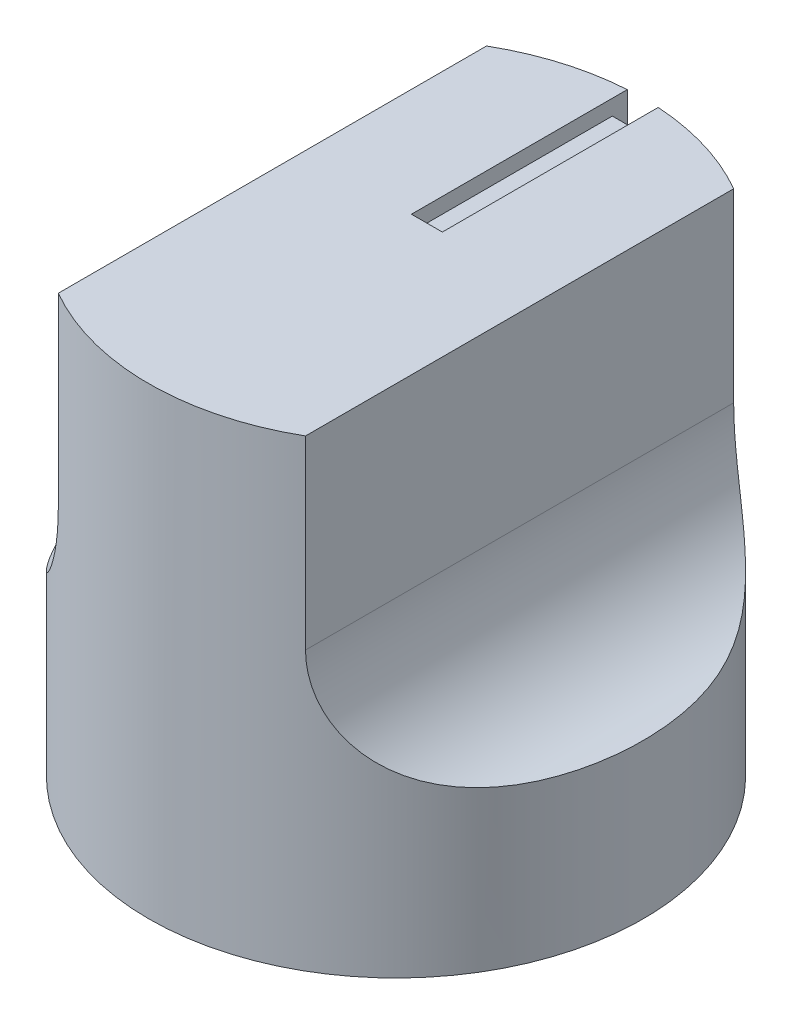
ISO-10303-21;
HEADER;
FILE_DESCRIPTION(('STEP AP214'),'2;1');
FILE_NAME('part.step','',(''),(''),'','','');
FILE_SCHEMA(('AUTOMOTIVE_DESIGN { 1 0 10303 214 1 1 1 1 }'));
ENDSEC;
DATA;
#1=APPLICATION_CONTEXT('core data for automotive mechanical design processes');
#2=APPLICATION_PROTOCOL_DEFINITION('international standard','automotive_design',2000,#1);
#3=PRODUCT_CONTEXT('',#1,'mechanical');
#4=PRODUCT('Part','Part','',(#3));
#5=PRODUCT_RELATED_PRODUCT_CATEGORY('part','',(#4));
#6=PRODUCT_DEFINITION_FORMATION('','',#4);
#7=PRODUCT_DEFINITION_CONTEXT('part definition',#1,'design');
#8=PRODUCT_DEFINITION('design','',#6,#7);
#9=PRODUCT_DEFINITION_SHAPE('','',#8);
#10=(LENGTH_UNIT() NAMED_UNIT(*) SI_UNIT(.MILLI.,.METRE.));
#11=(NAMED_UNIT(*) PLANE_ANGLE_UNIT() SI_UNIT($,.RADIAN.));
#12=(NAMED_UNIT(*) SI_UNIT($,.STERADIAN.) SOLID_ANGLE_UNIT());
#13=UNCERTAINTY_MEASURE_WITH_UNIT(LENGTH_MEASURE(1.E-05),#10,'distance_accuracy_value','');
#14=(GEOMETRIC_REPRESENTATION_CONTEXT(3) GLOBAL_UNCERTAINTY_ASSIGNED_CONTEXT((#13)) GLOBAL_UNIT_ASSIGNED_CONTEXT((#10,
#11,#12)) REPRESENTATION_CONTEXT('',''));
#15=CARTESIAN_POINT('',(0.,0.,0.));
#16=DIRECTION('',(0.,0.,1.));
#17=DIRECTION('',(1.,0.,0.));
#18=AXIS2_PLACEMENT_3D('',#15,#16,#17);
#19=CARTESIAN_POINT('',(0.,3.,0.));
#20=DIRECTION('',(0.,-1.,0.));
#21=DIRECTION('',(0.,0.,-1.));
#22=AXIS2_PLACEMENT_3D('',#19,#20,#21);
#23=CYLINDRICAL_SURFACE('',#22,6.45);
#24=CARTESIAN_POINT('',(0.,3.,0.));
#25=DIRECTION('',(0.,-1.,0.));
#26=DIRECTION('',(0.,0.,-1.));
#27=AXIS2_PLACEMENT_3D('',#24,#25,#26);
#28=CIRCLE('',#27,6.45);
#29=CARTESIAN_POINT('',(0.,3.,-6.45));
#30=VERTEX_POINT('',#29);
#31=EDGE_CURVE('E11',#30,#30,#28,.T.);
#32=ORIENTED_EDGE('',*,*,#31,.T.);
#33=EDGE_LOOP('',(#32));
#34=FACE_BOUND('',#33,.T.);
#35=CARTESIAN_POINT('',(0.,0.,0.));
#36=DIRECTION('',(0.,-1.,0.));
#37=DIRECTION('',(0.,0.,-1.));
#38=AXIS2_PLACEMENT_3D('',#35,#36,#37);
#39=CIRCLE('',#38,6.45);
#40=CARTESIAN_POINT('',(0.,0.,-6.45));
#41=VERTEX_POINT('',#40);
#42=EDGE_CURVE('E43',#41,#41,#39,.T.);
#43=ORIENTED_EDGE('',*,*,#42,.F.);
#44=EDGE_LOOP('',(#43));
#45=FACE_BOUND('',#44,.T.);
#46=ADVANCED_FACE('F40',(#34,#45),#23,.T.);
#47=CARTESIAN_POINT('',(0.,3.,0.));
#48=DIRECTION('',(0.,-1.,0.));
#49=DIRECTION('',(0.,0.,-1.));
#50=AXIS2_PLACEMENT_3D('',#47,#48,#49);
#51=PLANE('',#50);
#52=CARTESIAN_POINT('',(0.,3.,0.));
#53=DIRECTION('',(0.,-1.,0.));
#54=DIRECTION('',(0.,0.,-1.));
#55=AXIS2_PLACEMENT_3D('',#52,#53,#54);
#56=CIRCLE('',#55,3.8);
#57=CARTESIAN_POINT('',(0.,3.,-3.8));
#58=VERTEX_POINT('',#57);
#59=EDGE_CURVE('E50',#58,#58,#56,.T.);
#60=ORIENTED_EDGE('',*,*,#59,.T.);
#61=EDGE_LOOP('',(#60));
#62=FACE_BOUND('',#61,.T.);
#63=ORIENTED_EDGE('',*,*,#31,.F.);
#64=EDGE_LOOP('',(#63));
#65=FACE_BOUND('',#64,.T.);
#66=ADVANCED_FACE('F58',(#62,#65),#51,.F.);
#67=CARTESIAN_POINT('',(0.,0.,0.));
#68=DIRECTION('',(0.,-1.,0.));
#69=DIRECTION('',(0.,0.,-1.));
#70=AXIS2_PLACEMENT_3D('',#67,#68,#69);
#71=PLANE('',#70);
#72=CARTESIAN_POINT('',(0.,0.,0.));
#73=DIRECTION('',(0.,-1.,0.));
#74=DIRECTION('',(0.,0.,-1.));
#75=AXIS2_PLACEMENT_3D('',#72,#73,#74);
#76=CIRCLE('',#75,3.8);
#77=CARTESIAN_POINT('',(0.,0.,-3.8));
#78=VERTEX_POINT('',#77);
#79=EDGE_CURVE('E52',#78,#78,#76,.T.);
#80=ORIENTED_EDGE('',*,*,#79,.F.);
#81=EDGE_LOOP('',(#80));
#82=FACE_BOUND('',#81,.T.);
#83=ORIENTED_EDGE('',*,*,#42,.T.);
#84=EDGE_LOOP('',(#83));
#85=FACE_BOUND('',#84,.T.);
#86=ADVANCED_FACE('F64',(#82,#85),#71,.T.);
#87=CARTESIAN_POINT('',(0.,3.,0.));
#88=DIRECTION('',(0.,-1.,0.));
#89=DIRECTION('',(0.,0.,-1.));
#90=AXIS2_PLACEMENT_3D('',#87,#88,#89);
#91=CYLINDRICAL_SURFACE('',#90,3.8);
#92=ORIENTED_EDGE('',*,*,#59,.F.);
#93=EDGE_LOOP('',(#92));
#94=FACE_BOUND('',#93,.T.);
#95=ORIENTED_EDGE('',*,*,#79,.T.);
#96=EDGE_LOOP('',(#95));
#97=FACE_BOUND('',#96,.T.);
#98=ADVANCED_FACE('F61',(#94,#97),#91,.F.);
#99=CLOSED_SHELL('',(#46,#66,#86,#98));
#100=MANIFOLD_SOLID_BREP('B2',#99);
#101=CARTESIAN_POINT('',(0.,15.,0.));
#102=DIRECTION('',(0.,-1.,0.));
#103=DIRECTION('',(0.,0.,-1.));
#104=AXIS2_PLACEMENT_3D('',#101,#102,#103);
#105=CYLINDRICAL_SURFACE('',#104,8.);
#106=CARTESIAN_POINT('',(0.,0.,0.));
#107=DIRECTION('',(0.,1.,0.));
#108=DIRECTION('',(0.,0.,1.));
#109=AXIS2_PLACEMENT_3D('',#106,#107,#108);
#110=CIRCLE('',#109,8.);
#111=CARTESIAN_POINT('',(-0.5,0.,-7.98435971133565));
#112=VERTEX_POINT('',#111);
#113=CARTESIAN_POINT('',(0.5,0.,-7.98435971133565));
#114=VERTEX_POINT('',#113);
#115=EDGE_CURVE('E248',#112,#114,#110,.T.);
#116=ORIENTED_EDGE('',*,*,#115,.T.);
#117=DIRECTION('',(0.,-1.,0.));
#118=VECTOR('',#117,1.);
#119=CARTESIAN_POINT('',(0.5,15.,-7.98435971133565));
#120=LINE('',#119,#118);
#121=CARTESIAN_POINT('',(0.5,15.,-7.98435971133565));
#122=VERTEX_POINT('',#121);
#123=EDGE_CURVE('E109',#114,#122,#120,.F.);
#124=ORIENTED_EDGE('',*,*,#123,.T.);
#125=CARTESIAN_POINT('',(0.,15.,0.));
#126=DIRECTION('',(0.,1.,0.));
#127=DIRECTION('',(0.,0.,1.));
#128=AXIS2_PLACEMENT_3D('',#125,#126,#127);
#129=CIRCLE('',#128,8.);
#130=CARTESIAN_POINT('',(4.,15.,-6.92820323027551));
#131=VERTEX_POINT('',#130);
#132=EDGE_CURVE('E253',#131,#122,#129,.T.);
#133=ORIENTED_EDGE('',*,*,#132,.F.);
#134=DIRECTION('',(0.,-1.,0.));
#135=VECTOR('',#134,1.);
#136=CARTESIAN_POINT('',(4.,15.,-6.92820323027551));
#137=LINE('',#136,#135);
#138=CARTESIAN_POINT('',(4.,9.,-6.92820323027551));
#139=VERTEX_POINT('',#138);
#140=EDGE_CURVE('E241',#131,#139,#137,.T.);
#141=ORIENTED_EDGE('',*,*,#140,.T.);
#142=CARTESIAN_POINT('',(4.,9.,-6.92820323027551));
#143=CARTESIAN_POINT('',(3.9999835722425,8.90200515013691,-6.92819687410735));
#144=CARTESIAN_POINT('',(4.00360043340264,8.80401188244841,-6.9261240227385));
#145=CARTESIAN_POINT('',(4.01798276798626,8.60873570848839,-6.91779893875372));
#146=CARTESIAN_POINT('',(4.02874781000819,8.51145275970643,-6.91154695835323));
#147=CARTESIAN_POINT('',(4.05728899691143,8.31842478046616,-6.8948286993831));
#148=CARTESIAN_POINT('',(4.07505551335688,8.22267782510478,-6.88436820795136));
#149=CARTESIAN_POINT('',(4.11736554168773,8.03327199832824,-6.85914798190404));
#150=CARTESIAN_POINT('',(4.14190895354734,7.93961309611583,-6.84438831074345));
#151=CARTESIAN_POINT('',(4.19746101487635,7.75501328537845,-6.8104609571265));
#152=CARTESIAN_POINT('',(4.22847203616782,7.66407338800315,-6.79129165729093));
#153=CARTESIAN_POINT('',(4.29654650358197,7.48554906331703,-6.74842986488926));
#154=CARTESIAN_POINT('',(4.33361216584693,7.39796587918973,-6.7247357155819));
#155=CARTESIAN_POINT('',(4.41324580286913,7.22684069241129,-6.6727444832938));
#156=CARTESIAN_POINT('',(4.45580978785766,7.14329581924895,-6.64445073412743));
#157=CARTESIAN_POINT('',(4.54587613481682,6.98067527510326,-6.58315867012874));
#158=CARTESIAN_POINT('',(4.5933803104103,6.90160126200629,-6.55015862587755));
#159=CARTESIAN_POINT('',(4.69290796413624,6.74798783046527,-6.4792254778006));
#160=CARTESIAN_POINT('',(4.74495423874842,6.67347490575537,-6.44126695188476));
#161=CARTESIAN_POINT('',(4.852602391186,6.52978464844852,-6.36056521178928));
#162=CARTESIAN_POINT('',(4.90820553628836,6.46060923713861,-6.31782028814789));
#163=CARTESIAN_POINT('',(5.07916803374714,6.26152367084069,-6.18248162788317));
#164=CARTESIAN_POINT('',(5.19875091452228,6.13994785248332,-6.0827351957496));
#165=CARTESIAN_POINT('',(5.45018821795654,5.91309823520741,-5.8587972011498));
#166=CARTESIAN_POINT('',(5.58234444563209,5.80929448274484,-5.73347656075242));
#167=CARTESIAN_POINT('',(5.84541736244444,5.62605488345185,-5.46501709005642));
#168=CARTESIAN_POINT('',(5.97633345512774,5.54663023729272,-5.32187011200171));
#169=CARTESIAN_POINT('',(6.19989900396769,5.42627315003248,-5.05800022202342));
#170=CARTESIAN_POINT('',(6.29397602939143,5.38067994937706,-4.94053971650036));
#171=CARTESIAN_POINT('',(6.47692504289753,5.29996761174969,-4.69813684152143));
#172=CARTESIAN_POINT('',(6.56579488818492,5.26485276270943,-4.5731914341527));
#173=CARTESIAN_POINT('',(6.7372577248798,5.20344923127442,-4.31662247507116));
#174=CARTESIAN_POINT('',(6.81983688297195,5.17717958940873,-4.18498520999598));
#175=CARTESIAN_POINT('',(6.97767616680622,5.13197837366049,-3.91616493360132));
#176=CARTESIAN_POINT('',(7.05293434827596,5.11304874514201,-3.77898046269936));
#177=CARTESIAN_POINT('',(7.21967322379826,5.07563008091141,-3.45258095752635));
#178=CARTESIAN_POINT('',(7.30800946701544,5.0594639629425,-3.26148721369789));
#179=CARTESIAN_POINT('',(7.46948016307689,5.03449604217453,-2.87250009121431));
#180=CARTESIAN_POINT('',(7.54260970618666,5.02569661506718,-2.6746045404403));
#181=CARTESIAN_POINT('',(7.67304641667369,5.01284593772434,-2.27350709522336));
#182=CARTESIAN_POINT('',(7.73035210338644,5.0087951317102,-2.07030470615671));
#183=CARTESIAN_POINT('',(7.8287230023349,5.00336503278157,-1.66000115984097));
#184=CARTESIAN_POINT('',(7.86978974461307,5.00198548813159,-1.45290037182838));
#185=CARTESIAN_POINT('',(7.93589866811422,5.00037465285776,-1.0331050430258));
#186=CARTESIAN_POINT('',(7.96070244115308,5.00016012370093,-0.82037287857853));
#187=CARTESIAN_POINT('',(7.99317690069333,4.99997282201595,-0.393601563439323));
#188=CARTESIAN_POINT('',(8.00084723416683,5.00000005446914,-0.179562385908006));
#189=CARTESIAN_POINT('',(7.99900409932795,4.99999994600007,0.248535668334523));
#190=CARTESIAN_POINT('',(7.98948318837758,4.99997258144049,0.462594513439574));
#191=CARTESIAN_POINT('',(7.95330499069097,5.00023199564045,0.889257947956167));
#192=CARTESIAN_POINT('',(7.92664758786675,5.00051877652814,1.1018625275062));
#193=CARTESIAN_POINT('',(7.85453693676795,5.0024740538076,1.53524548879987));
#194=CARTESIAN_POINT('',(7.80817778657693,5.00421367453819,1.75587350364351));
#195=CARTESIAN_POINT('',(7.69701030356687,5.01110341546063,2.19243528479369));
#196=CARTESIAN_POINT('',(7.63219829929158,5.01625421462539,2.40836810771346));
#197=CARTESIAN_POINT('',(7.4847372971087,5.03263282779193,2.83360272537685));
#198=CARTESIAN_POINT('',(7.40210551417363,5.04385479236036,3.04291069788407));
#199=CARTESIAN_POINT('',(7.2198176518114,5.07573251191517,3.45319298052435));
#200=CARTESIAN_POINT('',(7.12017065331112,5.09638324460983,3.65417166521782));
#201=CARTESIAN_POINT('',(6.94246644788377,5.14165062466312,3.97787745786033));
#202=CARTESIAN_POINT('',(6.86887366443633,5.16242085718355,4.10361263117451));
#203=CARTESIAN_POINT('',(6.71560401472481,5.21096443384684,4.34990534633432));
#204=CARTESIAN_POINT('',(6.63592882679414,5.23873585096963,4.47046430222393));
#205=CARTESIAN_POINT('',(6.4714163821079,5.30254118291035,4.70545535859407));
#206=CARTESIAN_POINT('',(6.38658755489698,5.33856185864803,4.81989691765251));
#207=CARTESIAN_POINT('',(6.21274572706049,5.4202044149101,5.04198935516655));
#208=CARTESIAN_POINT('',(6.12373363032192,5.46582422867077,5.14964168891702));
#209=CARTESIAN_POINT('',(5.96163169971906,5.55735020283785,5.33581223429792));
#210=CARTESIAN_POINT('',(5.88904755187229,5.60125377643106,5.41575760634648));
#211=CARTESIAN_POINT('',(5.74304972581093,5.6964014240122,5.57033873976989));
#212=CARTESIAN_POINT('',(5.6696362275839,5.74764393244294,5.64497562849256));
#213=CARTESIAN_POINT('',(5.52301366733616,5.85787524674273,5.78850976877604));
#214=CARTESIAN_POINT('',(5.44980458320885,5.91686317899093,5.85740766621815));
#215=CARTESIAN_POINT('',(5.30475134112474,6.04282917569553,5.98909084055749));
#216=CARTESIAN_POINT('',(5.23290719650679,6.1098073181896,6.05187605774336));
#217=CARTESIAN_POINT('',(5.09131854481067,6.25232188729707,6.17147713837903));
#218=CARTESIAN_POINT('',(5.02159394973688,6.3279190267428,6.22824443153859));
#219=CARTESIAN_POINT('',(4.8861625366048,6.48704780335284,6.33504977878511));
#220=CARTESIAN_POINT('',(4.82045530748055,6.57057862648387,6.38508852198298));
#221=CARTESIAN_POINT('',(4.69437261082681,6.74513454723132,6.47834996407541));
#222=CARTESIAN_POINT('',(4.63399688188037,6.83615927697917,6.52157299724322));
#223=CARTESIAN_POINT('',(4.51981351149139,7.02503801310311,6.60122225704981));
#224=CARTESIAN_POINT('',(4.46600489466706,7.12289100190888,6.63764949346169));
#225=CARTESIAN_POINT('',(4.37229876928447,7.31195794770743,6.699683224821));
#226=CARTESIAN_POINT('',(4.33150311480748,7.40247216656111,6.72607320068346));
#227=CARTESIAN_POINT('',(4.25639507181425,7.58742040868101,6.77385290061837));
#228=CARTESIAN_POINT('',(4.22208206778328,7.68185405876557,6.79524309945546));
#229=CARTESIAN_POINT('',(4.16047772400686,7.87384549289628,6.83313506277601));
#230=CARTESIAN_POINT('',(4.13318043533467,7.9714005506986,6.84964097066958));
#231=CARTESIAN_POINT('',(4.08597229460042,8.16891782100564,6.87790536535641));
#232=CARTESIAN_POINT('',(4.06605885415348,8.26887917687969,6.88966551588799));
#233=CARTESIAN_POINT('',(4.03338629630058,8.47364611500904,6.9088485348705));
#234=CARTESIAN_POINT('',(4.0208730611694,8.57850497125034,6.91612264975934));
#235=CARTESIAN_POINT('',(4.00417639291733,8.78891013511775,6.92579129141725));
#236=CARTESIAN_POINT('',(3.99997752893938,8.89445480382254,6.92819485775773));
#237=CARTESIAN_POINT('',(4.,9.,6.92820323027551));
#238=B_SPLINE_CURVE_WITH_KNOTS('',3,(#142,#143,#144,#145,#146,#147,#148,#149,#150,#151,#152,
#153,#154,#155,#156,#157,#158,#159,#160,#161,#162,#163,#164,#165,#166,#167,#168,#169,#170,#171,
#172,#173,#174,#175,#176,#177,#178,#179,#180,#181,#182,#183,#184,#185,#186,#187,#188,#189,#190,
#191,#192,#193,#194,#195,#196,#197,#198,#199,#200,#201,#202,#203,#204,#205,#206,#207,#208,#209,
#210,#211,#212,#213,#214,#215,#216,#217,#218,#219,#220,#221,#222,#223,#224,#225,#226,#227,#228,
#229,#230,#231,#232,#233,#234,#235,#236,#237),.UNSPECIFIED.,.F.,.F.,(4,2,2,2,2,2,2,2,2,2,2,2,2,
2,2,2,2,2,2,2,2,2,2,2,2,2,2,2,2,2,2,2,2,2,2,2,2,2,2,2,2,2,2,2,2,2,2,4),(0.,0.293893692414347,
0.587769649592562,0.881242870651832,1.17471176032868,1.46828846167718,1.76197286084344,
2.05544533736351,2.34902593521375,2.64417557174289,2.93943095920887,3.52953675069302,
4.15607819353379,4.78290706351439,5.25403152085577,5.72534850731815,6.1976736774062,
6.67012394500356,7.30266881905536,7.93541760465959,8.5682255775702,9.20097391274415,
9.84280215588045,10.4846436235174,11.1267630314244,11.7688867892965,12.4444250112155,
13.1200977350561,13.7951206195504,14.4697843676346,14.9109411024683,15.3519765447573,
15.7923090770895,16.2325468994819,16.5819187832327,16.9312162489325,17.2804743505065,
17.629735863446,17.9816304003067,18.3334888700564,18.685330077704,19.0371189642967,
19.3449211343937,19.6526940645851,19.9602051533862,20.2676083429987,20.5847225831056,
20.9012477289834),.UNSPECIFIED.);
#239=CARTESIAN_POINT('',(4.,9.,6.92820323027551));
#240=VERTEX_POINT('',#239);
#241=EDGE_CURVE('E260',#139,#240,#238,.T.);
#242=ORIENTED_EDGE('',*,*,#241,.T.);
#243=DIRECTION('',(0.,-1.,0.));
#244=VECTOR('',#243,1.);
#245=CARTESIAN_POINT('',(4.,15.,6.92820323027551));
#246=LINE('',#245,#244);
#247=CARTESIAN_POINT('',(4.,15.,6.92820323027551));
#248=VERTEX_POINT('',#247);
#249=EDGE_CURVE('E236',#240,#248,#246,.F.);
#250=ORIENTED_EDGE('',*,*,#249,.T.);
#251=CARTESIAN_POINT('',(-4.,15.,6.92820323027551));
#252=VERTEX_POINT('',#251);
#253=EDGE_CURVE('E249',#252,#248,#129,.T.);
#254=ORIENTED_EDGE('',*,*,#253,.F.);
#255=DIRECTION('',(0.,-1.,0.));
#256=VECTOR('',#255,1.);
#257=CARTESIAN_POINT('',(-4.,15.,6.92820323027551));
#258=LINE('',#257,#256);
#259=CARTESIAN_POINT('',(-4.,9.,6.92820323027551));
#260=VERTEX_POINT('',#259);
#261=EDGE_CURVE('E124',#252,#260,#258,.T.);
#262=ORIENTED_EDGE('',*,*,#261,.T.);
#263=CARTESIAN_POINT('',(-4.,9.,-6.92820323027551));
#264=CARTESIAN_POINT('',(-4.00000070990149,9.09776602355344,-6.92820330287687));
#265=CARTESIAN_POINT('',(-4.00358933509886,9.1955573585385,-6.92613477111611));
#266=CARTESIAN_POINT('',(-4.01790451974824,9.39047992600172,-6.91783995927107));
#267=CARTESIAN_POINT('',(-4.02863504847643,9.48761076104948,-6.91161136713138));
#268=CARTESIAN_POINT('',(-4.05712783924524,9.6806575971894,-6.8949247127317));
#269=CARTESIAN_POINT('',(-4.07490316094188,9.77657099865334,-6.88445879452402));
#270=CARTESIAN_POINT('',(-4.11726365035122,9.96634061672385,-6.85920894508524));
#271=CARTESIAN_POINT('',(-4.14185140886115,10.060196035988,-6.84442337095482));
#272=CARTESIAN_POINT('',(-4.19746597192239,10.2450028340334,-6.81045801367739));
#273=CARTESIAN_POINT('',(-4.2284829121503,10.3359584182188,-6.79128495763171));
#274=CARTESIAN_POINT('',(-4.29657133982773,10.5145127823699,-6.74841407897512));
#275=CARTESIAN_POINT('',(-4.33364504247477,10.6021103196382,-6.72471460033428));
#276=CARTESIAN_POINT('',(-4.41328255074227,10.7732327255928,-6.67272014456763));
#277=CARTESIAN_POINT('',(-4.45584043662692,10.8567618537531,-6.64443011416129));
#278=CARTESIAN_POINT('',(-4.54589274893096,11.0193523855586,-6.5831471265146));
#279=CARTESIAN_POINT('',(-4.59338898767261,11.0984121324409,-6.55015244105506));
#280=CARTESIAN_POINT('',(-4.69290956944701,11.2520146454543,-6.47922433425811));
#281=CARTESIAN_POINT('',(-4.74495759102087,11.326529892858,-6.44126450718063));
#282=CARTESIAN_POINT('',(-4.85260944400998,11.4702244410966,-6.36055985576731));
#283=CARTESIAN_POINT('',(-4.90821454297109,11.5394018202184,-6.31781332159535));
#284=CARTESIAN_POINT('',(-5.07917574833982,11.7384841797498,-6.18247519640123));
#285=CARTESIAN_POINT('',(-5.19875484613128,11.8600556964283,-6.0827316935506));
#286=CARTESIAN_POINT('',(-5.45018504864899,12.0868989035289,-5.85880002445516));
#287=CARTESIAN_POINT('',(-5.58233798096011,12.1907004412388,-5.73348269799996));
#288=CARTESIAN_POINT('',(-5.84541095448471,12.3739412271099,-5.46502408895546));
#289=CARTESIAN_POINT('',(-5.97633033585862,12.4533680826962,-5.3218737915539));
#290=CARTESIAN_POINT('',(-6.19989989841727,12.5737273320564,-5.05799916786946));
#291=CARTESIAN_POINT('',(-6.29397777861536,12.6193208986644,-4.94053753275898));
#292=CARTESIAN_POINT('',(-6.47692839150713,12.7000337892319,-4.69813227081212));
#293=CARTESIAN_POINT('',(-6.56579898148471,12.7351488254334,-4.57318560618431));
#294=CARTESIAN_POINT('',(-6.73726158001414,12.796552026693,-4.31661640855879));
#295=CARTESIAN_POINT('',(-6.81983987502246,12.8228213162013,-4.18498028101974));
#296=CARTESIAN_POINT('',(-6.97767756144808,12.8680219769797,-3.9161623913565));
#297=CARTESIAN_POINT('',(-7.05293500875471,12.8869514030528,-3.77897916977416));
#298=CARTESIAN_POINT('',(-7.21967304702145,12.9243698794525,-3.45258130358329));
#299=CARTESIAN_POINT('',(-7.30800914010969,12.9405359771436,-3.26148792098286));
#300=CARTESIAN_POINT('',(-7.46947959456335,12.9655038792807,-2.87250154109829));
#301=CARTESIAN_POINT('',(-7.54260904602782,12.9743033079526,-2.67460637162059));
#302=CARTESIAN_POINT('',(-7.67304587352829,12.9871540207962,-2.27350896426308));
#303=CARTESIAN_POINT('',(-7.73035171063053,12.9912048432641,-2.07030621229374));
#304=CARTESIAN_POINT('',(-7.82872285089215,12.9966349622046,-1.66000192355134));
#305=CARTESIAN_POINT('',(-7.86978968410734,12.9980145104152,-1.45290075601823));
#306=CARTESIAN_POINT('',(-7.93589867463977,12.9996253472799,-1.03310500161348));
#307=CARTESIAN_POINT('',(-7.96070245085685,12.999839876372,-0.820372795362573));
#308=CARTESIAN_POINT('',(-7.99317691001474,13.0000271780208,-0.393601396628912));
#309=CARTESIAN_POINT('',(-8.00084723995513,12.9999999455964,-0.179562177308864));
#310=CARTESIAN_POINT('',(-7.99900409174175,13.0000000540503,0.248535876692019));
#311=CARTESIAN_POINT('',(-7.98948317762883,13.0000274185445,0.462594679794784));
#312=CARTESIAN_POINT('',(-7.95330498032008,12.9997680042235,0.889258030671059));
#313=CARTESIAN_POINT('',(-7.92664758103239,12.9994812232801,1.10186256858273));
#314=CARTESIAN_POINT('',(-7.8545369374175,12.9975259462168,1.53524548489373));
#315=CARTESIAN_POINT('',(-7.80817778820372,12.9957863255236,1.75587349590159));
#316=CARTESIAN_POINT('',(-7.69701030779563,12.9888965848404,2.19243526954058));
#317=CARTESIAN_POINT('',(-7.63219830514726,12.9837457858778,2.4083680887855));
#318=CARTESIAN_POINT('',(-7.48473730429051,12.9673671731528,2.83360270670667));
#319=CARTESIAN_POINT('',(-7.40210552043905,12.9561452086145,3.04291068292555));
#320=CARTESIAN_POINT('',(-7.21981765548318,12.9242674888477,3.45319297311545));
#321=CARTESIAN_POINT('',(-7.12017065527741,12.9036167558951,3.65417166163323));
#322=CARTESIAN_POINT('',(-6.94246647686326,12.8583493827163,3.97787740507314));
#323=CARTESIAN_POINT('',(-6.8688737251568,12.8375791599449,4.10361252743341));
#324=CARTESIAN_POINT('',(-6.71560411070063,12.7890355986533,4.3499051982693));
#325=CARTESIAN_POINT('',(-6.63592892365583,12.7612641841349,4.47046415857415));
#326=CARTESIAN_POINT('',(-6.4714164675322,12.6974588526793,4.70545524185686));
#327=CARTESIAN_POINT('',(-6.38658762719628,12.6614381735612,4.81989682251143));
#328=CARTESIAN_POINT('',(-6.21274576716995,12.5797956056705,5.04198930669649));
#329=CARTESIAN_POINT('',(-6.12373365113981,12.5341757831431,5.14964166515694));
#330=CARTESIAN_POINT('',(-5.96163113307115,12.4426494771741,5.33581288496264));
#331=CARTESIAN_POINT('',(-5.88904640441823,12.398745529412,5.41575886983283));
#332=CARTESIAN_POINT('',(-5.74304943524137,12.3035983330251,5.5703389988925));
#333=CARTESIAN_POINT('',(-5.66963739810161,12.2523568534861,5.64497441699048));
#334=CARTESIAN_POINT('',(-5.52301589536435,12.1421265223312,5.78850765331924));
#335=CARTESIAN_POINT('',(-5.44980641259024,12.0831383495611,5.85740597343075));
#336=CARTESIAN_POINT('',(-5.30475228736507,11.9571717061189,5.98909001356301));
#337=CARTESIAN_POINT('',(-5.23290765997551,11.8901931473304,6.05187566616055));
#338=CARTESIAN_POINT('',(-5.09131824840415,11.747677815345,6.1714773888437));
#339=CARTESIAN_POINT('',(-5.02159337010758,11.6720803481191,6.22824490361441));
#340=CARTESIAN_POINT('',(-4.88615278633931,11.5129406842463,6.33505745289827));
#341=CARTESIAN_POINT('',(-4.82043718083188,11.4293982896392,6.38510231983118));
#342=CARTESIAN_POINT('',(-4.69435260749895,11.2548357471545,6.47836437006798));
#343=CARTESIAN_POINT('',(-4.63398225596499,11.1638175463442,6.521583322658));
#344=CARTESIAN_POINT('',(-4.51980739369818,10.9749508501995,6.60122640137803));
#345=CARTESIAN_POINT('',(-4.46600205313775,10.8771032205785,6.63765138658443));
#346=CARTESIAN_POINT('',(-4.37232722685247,10.6880995086601,6.69966437531455));
#347=CARTESIAN_POINT('',(-4.331556214559,10.5976457795977,6.72603881377807));
#348=CARTESIAN_POINT('',(-4.25647234687928,10.4127826606064,6.77380434945974));
#349=CARTESIAN_POINT('',(-4.22216169807527,10.3183719325495,6.79519374459254));
#350=CARTESIAN_POINT('',(-4.16054936567877,10.1263998903568,6.83309137336605));
#351=CARTESIAN_POINT('',(-4.13324376208968,10.0288403728362,6.84960233774637));
#352=CARTESIAN_POINT('',(-4.08600425338262,9.83123988245688,6.87788694704262));
#353=CARTESIAN_POINT('',(-4.06607304636665,9.73119801562722,6.88965885819933));
#354=CARTESIAN_POINT('',(-4.03462726640266,9.53414255719846,6.90811832761766));
#355=CARTESIAN_POINT('',(-4.02276497517198,9.43720393271993,6.9150165147));
#356=CARTESIAN_POINT('',(-4.00616022966299,9.24247732396191,6.92464966830118));
#357=CARTESIAN_POINT('',(-4.00142030353541,9.14468905047344,6.92738315652564));
#358=CARTESIAN_POINT('',(-3.99912887019422,8.94904717503638,6.92870622523126));
#359=CARTESIAN_POINT('',(-4.00157395297401,8.85119362610691,6.92729777147863));
#360=CARTESIAN_POINT('',(-4.01361664384383,8.65603990182341,6.92032728474647));
#361=CARTESIAN_POINT('',(-4.0232168838967,8.55873994337697,6.91476372334489));
#362=CARTESIAN_POINT('',(-4.04938887621379,8.36588998904652,6.89946938070487));
#363=CARTESIAN_POINT('',(-4.0659271297297,8.27033385665036,6.8897586193481));
#364=CARTESIAN_POINT('',(-4.10576759414658,8.08114058850231,6.86609123955536));
#365=CARTESIAN_POINT('',(-4.1290722692108,7.98750416518483,6.85213307423088));
#366=CARTESIAN_POINT('',(-4.1821277162462,7.80289081601536,6.81988048643909));
#367=CARTESIAN_POINT('',(-4.21187538850573,7.71191263509274,6.80158814873623));
#368=CARTESIAN_POINT('',(-4.27743764138413,7.53316790340114,6.76054900887817));
#369=CARTESIAN_POINT('',(-4.31325443820581,7.44540254011278,6.7378005790603));
#370=CARTESIAN_POINT('',(-4.39053601883212,7.27354178900328,6.68769872909116));
#371=CARTESIAN_POINT('',(-4.43201125264578,7.18945358074779,6.66033676607349));
#372=CARTESIAN_POINT('',(-4.51997420512893,7.02564337868167,6.60095865970766));
#373=CARTESIAN_POINT('',(-4.56646373204203,6.94592297571281,6.56894083591391));
#374=CARTESIAN_POINT('',(-4.71245380462405,6.71411629405484,6.46582761165787));
#375=CARTESIAN_POINT('',(-4.81856222471656,6.56919624706261,6.38761853067557));
#376=CARTESIAN_POINT('',(-5.04526632313501,6.29782934387071,6.21019472491874));
#377=CARTESIAN_POINT('',(-5.16617377792645,6.17198084964538,6.11047373896566));
#378=CARTESIAN_POINT('',(-5.41354621000537,5.9440948986103,5.89242278357558));
#379=CARTESIAN_POINT('',(-5.5400132673066,5.84206644524849,5.77408580590254));
#380=CARTESIAN_POINT('',(-5.75188083151402,5.68984375722648,5.56153650431224));
#381=CARTESIAN_POINT('',(-5.83744627515575,5.63351913601008,5.4717558046432));
#382=CARTESIAN_POINT('',(-6.00684827778962,5.53053819026654,5.28522734732031));
#383=CARTESIAN_POINT('',(-6.0906843235827,5.4838846995148,5.18847755878502));
#384=CARTESIAN_POINT('',(-6.2554328317939,5.39929436669955,4.98862376024073));
#385=CARTESIAN_POINT('',(-6.3363404507889,5.36137145475002,4.88550992387976));
#386=CARTESIAN_POINT('',(-6.49410950578001,5.293293118875,4.67375542023035));
#387=CARTESIAN_POINT('',(-6.57096981229405,5.26313985417757,4.565113226604));
#388=CARTESIAN_POINT('',(-6.74744089466729,5.1996229335774,4.30181256800476));
#389=CARTESIAN_POINT('',(-6.84493209019776,5.16920785268356,4.14501639473949));
#390=CARTESIAN_POINT('',(-7.02942498943289,5.11835788906532,3.82381135200353));
#391=CARTESIAN_POINT('',(-7.11642269353054,5.09792680275589,3.65939961268846));
#392=CARTESIAN_POINT('',(-7.27906552352811,5.06462833656944,3.3241466946258));
#393=CARTESIAN_POINT('',(-7.35469988456443,5.05176809556693,3.1532996086741));
#394=CARTESIAN_POINT('',(-7.49390247201554,5.03152277329121,2.80648294229948));
#395=CARTESIAN_POINT('',(-7.55747174676512,5.02413721616081,2.6305138084649));
#396=CARTESIAN_POINT('',(-7.67390606501344,5.01287193912906,2.268992583558));
#397=CARTESIAN_POINT('',(-7.72638299041423,5.00910669669513,2.0833121102635));
#398=CARTESIAN_POINT('',(-7.81778832716794,5.00389009728358,1.70861853912417));
#399=CARTESIAN_POINT('',(-7.85671654776933,5.00243877288245,1.51960539439818));
#400=CARTESIAN_POINT('',(-7.92080166377113,5.00065545973171,1.13932655115621));
#401=CARTESIAN_POINT('',(-7.94596373247855,5.00032305025259,0.948061726460444));
#402=CARTESIAN_POINT('',(-7.98240830748772,4.9999976164897,0.564209465191368));
#403=CARTESIAN_POINT('',(-7.99369002282592,5.00000461154577,0.371621953874336));
#404=CARTESIAN_POINT('',(-8.00299349065673,4.99999573656709,-0.0444410341855977));
#405=CARTESIAN_POINT('',(-7.99862997793694,4.99997606647677,-0.267973772760683));
#406=CARTESIAN_POINT('',(-7.97121316822046,5.00008077348956,-0.713917203824179));
#407=CARTESIAN_POINT('',(-7.94815699616058,5.00020517275281,-0.936327718411184));
#408=CARTESIAN_POINT('',(-7.88349029772063,5.00156643809818,-1.37861158838073));
#409=CARTESIAN_POINT('',(-7.84186518324387,5.00280417962064,-1.59848280924918));
#410=CARTESIAN_POINT('',(-7.74035856292256,5.00811183013009,-2.03391352517529));
#411=CARTESIAN_POINT('',(-7.68048034380136,5.0121812294071,-2.24947378904006));
#412=CARTESIAN_POINT('',(-7.55404541284902,5.0245167436503,-2.6403646322207));
#413=CARTESIAN_POINT('',(-7.49012393540432,5.03200003069208,-2.81657576613666));
#414=CARTESIAN_POINT('',(-7.35018419159859,5.05250157940943,-3.16383013104305));
#415=CARTESIAN_POINT('',(-7.27416566023942,5.06551996234729,-3.3348732487252));
#416=CARTESIAN_POINT('',(-7.11079027156441,5.09919876132549,-3.67034216097596));
#417=CARTESIAN_POINT('',(-7.02345269983747,5.11984628699431,-3.83477860169782));
#418=CARTESIAN_POINT('',(-6.83828190984266,5.17120948343663,-4.15598566986135));
#419=CARTESIAN_POINT('',(-6.74045273543933,5.2019212843698,-4.31275921719772));
#420=CARTESIAN_POINT('',(-6.56558835409386,5.26524397089478,-4.57274061873253));
#421=CARTESIAN_POINT('',(-6.49080442299516,5.29469164855152,-4.67824152122604));
#422=CARTESIAN_POINT('',(-6.33741436401343,5.36093608824065,-4.88401777042662));
#423=CARTESIAN_POINT('',(-6.25880924438915,5.39773091953074,-4.98429448127651));
#424=CARTESIAN_POINT('',(-6.09876909412752,5.47957545713966,-5.17888699015304));
#425=CARTESIAN_POINT('',(-6.01733704281613,5.52461667446443,-5.27320878522396));
#426=CARTESIAN_POINT('',(-5.8527374988197,5.62383490825504,-5.45532002257753));
#427=CARTESIAN_POINT('',(-5.76957030986473,5.67801033737139,-5.54311059604639));
#428=CARTESIAN_POINT('',(-5.61728668201901,5.78599540285445,-5.6969916946567));
#429=CARTESIAN_POINT('',(-5.5482179011228,5.83826025263288,-5.7642151117045));
#430=CARTESIAN_POINT('',(-5.41080358119952,5.94977262030687,-5.8933939121469));
#431=CARTESIAN_POINT('',(-5.34245790429195,6.00901877987768,-5.95535031629758));
#432=CARTESIAN_POINT('',(-5.20749541218392,6.13461791621789,-6.0737180192116));
#433=CARTESIAN_POINT('',(-5.1408786567809,6.20097113839019,-6.13012912636988));
#434=CARTESIAN_POINT('',(-5.01048237104742,6.34069375119145,-6.23716117042542));
#435=CARTESIAN_POINT('',(-4.94670150538108,6.41405978731863,-6.2877848504772));
#436=CARTESIAN_POINT('',(-4.82270079054602,6.5680071210973,-6.38339421787277));
#437=CARTESIAN_POINT('',(-4.76250176966358,6.64862484662977,-6.42834836393433));
#438=CARTESIAN_POINT('',(-4.64713287355551,6.81628039503238,-6.51223801705804));
#439=CARTESIAN_POINT('',(-4.59196092764808,6.90331554755423,-6.55117600685047));
#440=CARTESIAN_POINT('',(-4.48757009609148,7.08331814030528,-6.62312156061601));
#441=CARTESIAN_POINT('',(-4.43835591117853,7.17629017759168,-6.65612445157361));
#442=CARTESIAN_POINT('',(-4.34681645863214,7.36737328392717,-6.71626301046249));
#443=CARTESIAN_POINT('',(-4.30449040016806,7.46548376131627,-6.7433993520541));
#444=CARTESIAN_POINT('',(-4.23092849432817,7.65699624216335,-6.78976882956742));
#445=CARTESIAN_POINT('',(-4.19903780237081,7.75002892612944,-6.80949307296904));
#446=CARTESIAN_POINT('',(-4.14202357832112,7.93898443911894,-6.8443230619813));
#447=CARTESIAN_POINT('',(-4.11689955901342,8.03490705950729,-6.85942914012062));
#448=CARTESIAN_POINT('',(-4.073814016238,8.22870428121517,-6.88510472358034));
#449=CARTESIAN_POINT('',(-4.05583625250676,8.32657391968175,-6.89568451935484));
#450=CARTESIAN_POINT('',(-4.02721035738711,8.52370914690772,-6.91244198286113));
#451=CARTESIAN_POINT('',(-4.01655805249202,8.62297390787704,-6.9186221572438));
#452=CARTESIAN_POINT('',(-4.00642464439869,8.7687025408082,-6.92449074107638));
#453=CARTESIAN_POINT('',(-4.004016299395,8.81491608073672,-6.92588311217585));
#454=CARTESIAN_POINT('',(-4.00080380539194,8.90741785511395,-6.92773934174441));
#455=CARTESIAN_POINT('',(-3.99999966384932,8.95370608990886,-6.92820319589751));
#456=CARTESIAN_POINT('',(-4.,9.,-6.92820323027551));
#457=B_SPLINE_CURVE_WITH_KNOTS('',3,(#263,#264,#265,#266,#267,#268,#269,#270,#271,#272,#273,
#274,#275,#276,#277,#278,#279,#280,#281,#282,#283,#284,#285,#286,#287,#288,#289,#290,#291,#292,
#293,#294,#295,#296,#297,#298,#299,#300,#301,#302,#303,#304,#305,#306,#307,#308,#309,#310,#311,
#312,#313,#314,#315,#316,#317,#318,#319,#320,#321,#322,#323,#324,#325,#326,#327,#328,#329,#330,
#331,#332,#333,#334,#335,#336,#337,#338,#339,#340,#341,#342,#343,#344,#345,#346,#347,#348,#349,
#350,#351,#352,#353,#354,#355,#356,#357,#358,#359,#360,#361,#362,#363,#364,#365,#366,#367,#368,
#369,#370,#371,#372,#373,#374,#375,#376,#377,#378,#379,#380,#381,#382,#383,#384,#385,#386,#387,
#388,#389,#390,#391,#392,#393,#394,#395,#396,#397,#398,#399,#400,#401,#402,#403,#404,#405,#406,
#407,#408,#409,#410,#411,#412,#413,#414,#415,#416,#417,#418,#419,#420,#421,#422,#423,#424,#425,
#426,#427,#428,#429,#430,#431,#432,#433,#434,#435,#436,#437,#438,#439,#440,#441,#442,#443,#444,
#445,#446,#447,#448,#449,#450,#451,#452,#453,#454,#455,#456),.UNSPECIFIED.,.T.,.F.,(4,2,2,2,2,2,
2,2,2,2,2,2,2,2,2,2,2,2,2,2,2,2,2,2,2,2,2,2,2,2,2,2,2,2,2,2,2,2,2,2,2,2,2,2,2,2,2,2,2,2,2,2,2,2,
2,2,2,2,2,2,2,2,2,2,2,2,2,2,2,2,2,2,2,2,2,2,2,2,2,2,2,2,2,2,2,2,2,2,2,2,2,2,2,2,2,2,4),(0.,
0.293254362587133,0.586671844239998,0.880635827531812,1.17471176032936,1.46833978729855,
1.76207544705924,2.0554966577744,2.34902593355566,2.6441850719655,2.93944998108342,
3.52953679129149,4.15606294410501,4.78290710959589,5.25403594197832,5.72535729420498,
6.19767809775008,6.67012398946573,7.30266769357557,7.9354153165455,8.56822445605422,
9.20097395741387,9.84280232599552,10.4846439180466,11.1267632009512,11.7688868339664,
12.4444250440434,13.1200977559639,13.7951206517759,14.4697844123016,14.9109409652325,
15.3519764155615,15.7923090229214,16.2325469441126,16.5819215859758,16.9312121346714,
17.2804720952953,17.6297359078488,17.9816319170545,18.3335366965956,18.6853501117171,
19.0371190109063,19.3447208822932,19.6524276274145,19.9599618035524,20.2676083875273,
20.5609755996954,20.8544469207468,21.1477789827513,21.4412189977091,21.7332582152355,
22.0254039199002,22.3174093848833,22.6095217093385,22.9021810001496,23.1949461842359,
23.7798422027086,24.3803954457432,24.9811753184219,25.3893126902401,25.7975694834559,
26.2064732265247,26.615490483949,27.1760246640117,27.7367718217192,28.2980468885264,
28.8592731638203,29.4377131312314,30.0161612421399,30.5943918232097,31.1726553528738,
31.8425784270679,32.5126045597207,33.1831580065628,33.8535907822537,34.4158801574984,
34.9781818519534,35.5395377812069,36.1006781148237,36.4982467798697,36.8957111058941,
37.2927685515561,37.6897570672926,38.0183555026648,38.346890109228,38.6754360635668,
39.0038256406336,39.3339683310079,39.6639744130295,39.9942391993406,40.324466040928,
40.6250136257693,40.9255395647321,41.2253785828004,41.5250466328488,41.6639070211342,
41.8027680548759),.UNSPECIFIED.);
#458=CARTESIAN_POINT('',(-4.,9.,-6.92820323027551));
#459=VERTEX_POINT('',#458);
#460=EDGE_CURVE('E268',#260,#459,#457,.T.);
#461=ORIENTED_EDGE('',*,*,#460,.T.);
#462=DIRECTION('',(0.,-1.,0.));
#463=VECTOR('',#462,1.);
#464=CARTESIAN_POINT('',(-4.,15.,-6.92820323027551));
#465=LINE('',#464,#463);
#466=CARTESIAN_POINT('',(-4.,15.,-6.92820323027551));
#467=VERTEX_POINT('',#466);
#468=EDGE_CURVE('E244',#459,#467,#465,.F.);
#469=ORIENTED_EDGE('',*,*,#468,.T.);
#470=CARTESIAN_POINT('',(-0.5,15.,-7.98435971133565));
#471=VERTEX_POINT('',#470);
#472=EDGE_CURVE('E252',#471,#467,#129,.T.);
#473=ORIENTED_EDGE('',*,*,#472,.F.);
#474=DIRECTION('',(0.,-1.,0.));
#475=VECTOR('',#474,1.);
#476=CARTESIAN_POINT('',(-0.5,15.,-7.98435971133565));
#477=LINE('',#476,#475);
#478=EDGE_CURVE('E38',#471,#112,#477,.T.);
#479=ORIENTED_EDGE('',*,*,#478,.T.);
#480=EDGE_LOOP('',(#116,#124,#133,#141,#242,#250,#254,#262,#461,#469,#473,#479));
#481=FACE_BOUND('',#480,.T.);
#482=ADVANCED_FACE('F101',(#481),#105,.T.);
#483=CARTESIAN_POINT('',(0.,0.,0.));
#484=DIRECTION('',(0.,1.,0.));
#485=DIRECTION('',(0.,0.,1.));
#486=AXIS2_PLACEMENT_3D('',#483,#484,#485);
#487=PLANE('',#486);
#488=CARTESIAN_POINT('',(0.,0.,0.));
#489=DIRECTION('',(0.,-1.,0.));
#490=DIRECTION('',(0.,0.,-1.));
#491=AXIS2_PLACEMENT_3D('',#488,#489,#490);
#492=CIRCLE('',#491,6.5);
#493=CARTESIAN_POINT('',(0.,0.,-6.5));
#494=VERTEX_POINT('',#493);
#495=EDGE_CURVE('E220',#494,#494,#492,.T.);
#496=ORIENTED_EDGE('',*,*,#495,.F.);
#497=EDGE_LOOP('',(#496));
#498=FACE_BOUND('',#497,.T.);
#499=DIRECTION('',(0.,0.,-1.));
#500=VECTOR('',#499,1.);
#501=CARTESIAN_POINT('',(0.5,0.,-7.5));
#502=LINE('',#501,#500);
#503=CARTESIAN_POINT('',(0.5,0.,-7.5));
#504=VERTEX_POINT('',#503);
#505=EDGE_CURVE('E192',#504,#114,#502,.T.);
#506=ORIENTED_EDGE('',*,*,#505,.T.);
#507=ORIENTED_EDGE('',*,*,#115,.F.);
#508=DIRECTION('',(0.,0.,-1.));
#509=VECTOR('',#508,1.);
#510=CARTESIAN_POINT('',(-0.5,0.,-7.5));
#511=LINE('',#510,#509);
#512=CARTESIAN_POINT('',(-0.5,0.,-7.5));
#513=VERTEX_POINT('',#512);
#514=EDGE_CURVE('E209',#513,#112,#511,.T.);
#515=ORIENTED_EDGE('',*,*,#514,.F.);
#516=DIRECTION('',(1.,0.,0.));
#517=VECTOR('',#516,1.);
#518=CARTESIAN_POINT('',(0.5,0.,-7.5));
#519=LINE('',#518,#517);
#520=EDGE_CURVE('E351',#513,#504,#519,.T.);
#521=ORIENTED_EDGE('',*,*,#520,.T.);
#522=EDGE_LOOP('',(#506,#507,#515,#521));
#523=FACE_BOUND('',#522,.T.);
#524=ADVANCED_FACE('F286',(#498,#523),#487,.F.);
#525=CARTESIAN_POINT('',(0.,14.5,0.));
#526=DIRECTION('',(0.,-1.,0.));
#527=DIRECTION('',(0.,0.,-1.));
#528=AXIS2_PLACEMENT_3D('',#525,#526,#527);
#529=PLANE('',#528);
#530=DIRECTION('',(-1.,0.,0.));
#531=VECTOR('',#530,1.);
#532=CARTESIAN_POINT('',(0.5,14.5,-7.5));
#533=LINE('',#532,#531);
#534=CARTESIAN_POINT('',(0.5,14.5,-7.5));
#535=VERTEX_POINT('',#534);
#536=CARTESIAN_POINT('',(-0.5,14.5,-7.5));
#537=VERTEX_POINT('',#536);
#538=EDGE_CURVE('E177',#535,#537,#533,.T.);
#539=ORIENTED_EDGE('',*,*,#538,.T.);
#540=DIRECTION('',(0.,0.,1.));
#541=VECTOR('',#540,1.);
#542=CARTESIAN_POINT('',(-0.5,14.5,-1.));
#543=LINE('',#542,#541);
#544=CARTESIAN_POINT('',(-0.5,14.5,-1.));
#545=VERTEX_POINT('',#544);
#546=EDGE_CURVE('E202',#537,#545,#543,.T.);
#547=ORIENTED_EDGE('',*,*,#546,.T.);
#548=DIRECTION('',(1.,0.,0.));
#549=VECTOR('',#548,1.);
#550=CARTESIAN_POINT('',(-0.5,14.5,-1.));
#551=LINE('',#550,#549);
#552=CARTESIAN_POINT('',(0.5,14.5,-1.));
#553=VERTEX_POINT('',#552);
#554=EDGE_CURVE('E196',#545,#553,#551,.T.);
#555=ORIENTED_EDGE('',*,*,#554,.T.);
#556=DIRECTION('',(0.,0.,-1.));
#557=VECTOR('',#556,1.);
#558=CARTESIAN_POINT('',(0.5,14.5,-1.));
#559=LINE('',#558,#557);
#560=EDGE_CURVE('E189',#553,#535,#559,.T.);
#561=ORIENTED_EDGE('',*,*,#560,.T.);
#562=EDGE_LOOP('',(#539,#547,#555,#561));
#563=FACE_BOUND('',#562,.T.);
#564=ADVANCED_FACE('F194',(#563),#529,.F.);
#565=CARTESIAN_POINT('',(0.,0.,0.));
#566=DIRECTION('',(0.,-1.,0.));
#567=DIRECTION('',(0.,0.,-1.));
#568=AXIS2_PLACEMENT_3D('',#565,#566,#567);
#569=CIRCLE('',#568,3.);
#570=CARTESIAN_POINT('',(0.,0.,-3.));
#571=VERTEX_POINT('',#570);
#572=EDGE_CURVE('E223',#571,#571,#569,.T.);
#573=ORIENTED_EDGE('',*,*,#572,.F.);
#574=EDGE_LOOP('',(#573));
#575=FACE_BOUND('',#574,.T.);
#576=CARTESIAN_POINT('',(0.,0.,0.));
#577=DIRECTION('',(0.,-1.,0.));
#578=DIRECTION('',(0.,0.,-1.));
#579=AXIS2_PLACEMENT_3D('',#576,#577,#578);
#580=CIRCLE('',#579,3.75);
#581=CARTESIAN_POINT('',(0.,0.,-3.75));
#582=VERTEX_POINT('',#581);
#583=EDGE_CURVE('E214',#582,#582,#580,.T.);
#584=ORIENTED_EDGE('',*,*,#583,.T.);
#585=EDGE_LOOP('',(#584));
#586=FACE_BOUND('',#585,.T.);
#587=ADVANCED_FACE('F289',(#575,#586),#487,.F.);
#588=CARTESIAN_POINT('',(0.,13.,0.));
#589=DIRECTION('',(0.,-1.,0.));
#590=DIRECTION('',(0.,0.,-1.));
#591=AXIS2_PLACEMENT_3D('',#588,#589,#590);
#592=CYLINDRICAL_SURFACE('',#591,3.);
#593=CARTESIAN_POINT('',(0.,13.,0.));
#594=DIRECTION('',(0.,-1.,0.));
#595=DIRECTION('',(0.,0.,-1.));
#596=AXIS2_PLACEMENT_3D('',#593,#594,#595);
#597=CIRCLE('',#596,3.);
#598=CARTESIAN_POINT('',(0.,13.,-3.));
#599=VERTEX_POINT('',#598);
#600=EDGE_CURVE('E228',#599,#599,#597,.T.);
#601=ORIENTED_EDGE('',*,*,#600,.F.);
#602=EDGE_LOOP('',(#601));
#603=FACE_BOUND('',#602,.T.);
#604=ORIENTED_EDGE('',*,*,#572,.T.);
#605=EDGE_LOOP('',(#604));
#606=FACE_BOUND('',#605,.T.);
#607=ADVANCED_FACE('F299',(#603,#606),#592,.F.);
#608=CARTESIAN_POINT('',(0.,13.,0.));
#609=DIRECTION('',(0.,-1.,0.));
#610=DIRECTION('',(0.,0.,-1.));
#611=AXIS2_PLACEMENT_3D('',#608,#609,#610);
#612=PLANE('',#611);
#613=ORIENTED_EDGE('',*,*,#600,.T.);
#614=EDGE_LOOP('',(#613));
#615=FACE_BOUND('',#614,.T.);
#616=ADVANCED_FACE('F304',(#615),#612,.T.);
#617=CARTESIAN_POINT('',(0.,3.,0.));
#618=DIRECTION('',(0.,-1.,0.));
#619=DIRECTION('',(0.,0.,-1.));
#620=AXIS2_PLACEMENT_3D('',#617,#618,#619);
#621=CYLINDRICAL_SURFACE('',#620,3.75);
#622=CARTESIAN_POINT('',(0.,3.,0.));
#623=DIRECTION('',(0.,-1.,0.));
#624=DIRECTION('',(0.,0.,-1.));
#625=AXIS2_PLACEMENT_3D('',#622,#623,#624);
#626=CIRCLE('',#625,3.75);
#627=CARTESIAN_POINT('',(0.,3.,-3.75));
#628=VERTEX_POINT('',#627);
#629=EDGE_CURVE('E216',#628,#628,#626,.T.);
#630=ORIENTED_EDGE('',*,*,#629,.T.);
#631=EDGE_LOOP('',(#630));
#632=FACE_BOUND('',#631,.T.);
#633=ORIENTED_EDGE('',*,*,#583,.F.);
#634=EDGE_LOOP('',(#633));
#635=FACE_BOUND('',#634,.T.);
#636=ADVANCED_FACE('F311',(#632,#635),#621,.T.);
#637=CARTESIAN_POINT('',(0.,3.,0.));
#638=DIRECTION('',(0.,-1.,0.));
#639=DIRECTION('',(0.,0.,-1.));
#640=AXIS2_PLACEMENT_3D('',#637,#638,#639);
#641=CYLINDRICAL_SURFACE('',#640,6.5);
#642=CARTESIAN_POINT('',(0.,3.,0.));
#643=DIRECTION('',(0.,-1.,0.));
#644=DIRECTION('',(0.,0.,-1.));
#645=AXIS2_PLACEMENT_3D('',#642,#643,#644);
#646=CIRCLE('',#645,6.5);
#647=CARTESIAN_POINT('',(0.,3.,-6.5));
#648=VERTEX_POINT('',#647);
#649=EDGE_CURVE('E219',#648,#648,#646,.T.);
#650=ORIENTED_EDGE('',*,*,#649,.F.);
#651=EDGE_LOOP('',(#650));
#652=FACE_BOUND('',#651,.T.);
#653=ORIENTED_EDGE('',*,*,#495,.T.);
#654=EDGE_LOOP('',(#653));
#655=FACE_BOUND('',#654,.T.);
#656=ADVANCED_FACE('F313',(#652,#655),#641,.F.);
#657=CARTESIAN_POINT('',(0.,3.,0.));
#658=DIRECTION('',(0.,-1.,0.));
#659=DIRECTION('',(0.,0.,-1.));
#660=AXIS2_PLACEMENT_3D('',#657,#658,#659);
#661=PLANE('',#660);
#662=ORIENTED_EDGE('',*,*,#629,.F.);
#663=EDGE_LOOP('',(#662));
#664=FACE_BOUND('',#663,.T.);
#665=ORIENTED_EDGE('',*,*,#649,.T.);
#666=EDGE_LOOP('',(#665));
#667=FACE_BOUND('',#666,.T.);
#668=ADVANCED_FACE('F279',(#664,#667),#661,.T.);
#669=CARTESIAN_POINT('',(8.,9.,-15.));
#670=DIRECTION('',(0.,0.,1.));
#671=DIRECTION('',(1.,0.,0.));
#672=AXIS2_PLACEMENT_3D('',#669,#670,#671);
#673=CYLINDRICAL_SURFACE('',#672,4.);
#674=DIRECTION('',(0.,0.,1.));
#675=VECTOR('',#674,1.);
#676=CARTESIAN_POINT('',(4.,9.,-15.));
#677=LINE('',#676,#675);
#678=EDGE_CURVE('E231',#139,#240,#677,.T.);
#679=ORIENTED_EDGE('',*,*,#678,.T.);
#680=ORIENTED_EDGE('',*,*,#241,.F.);
#681=EDGE_LOOP('',(#679,#680));
#682=FACE_BOUND('',#681,.T.);
#683=ADVANCED_FACE('F273',(#682),#673,.F.);
#684=CARTESIAN_POINT('',(4.,15.,-15.));
#685=DIRECTION('',(-1.,0.,0.));
#686=DIRECTION('',(0.,0.,1.));
#687=AXIS2_PLACEMENT_3D('',#684,#685,#686);
#688=PLANE('',#687);
#689=DIRECTION('',(0.,0.,1.));
#690=VECTOR('',#689,1.);
#691=CARTESIAN_POINT('',(4.,15.,0.));
#692=LINE('',#691,#690);
#693=EDGE_CURVE('E256',#131,#248,#692,.T.);
#694=ORIENTED_EDGE('',*,*,#693,.T.);
#695=ORIENTED_EDGE('',*,*,#249,.F.);
#696=ORIENTED_EDGE('',*,*,#678,.F.);
#697=ORIENTED_EDGE('',*,*,#140,.F.);
#698=EDGE_LOOP('',(#694,#695,#696,#697));
#699=FACE_BOUND('',#698,.T.);
#700=ADVANCED_FACE('F278',(#699),#688,.F.);
#701=CARTESIAN_POINT('',(-8.,9.,-15.));
#702=DIRECTION('',(0.,0.,1.));
#703=DIRECTION('',(1.,0.,0.));
#704=AXIS2_PLACEMENT_3D('',#701,#702,#703);
#705=CYLINDRICAL_SURFACE('',#704,4.);
#706=DIRECTION('',(0.,0.,1.));
#707=VECTOR('',#706,1.);
#708=CARTESIAN_POINT('',(-4.,9.,-15.));
#709=LINE('',#708,#707);
#710=EDGE_CURVE('E234',#459,#260,#709,.T.);
#711=ORIENTED_EDGE('',*,*,#710,.F.);
#712=ORIENTED_EDGE('',*,*,#460,.F.);
#713=EDGE_LOOP('',(#711,#712));
#714=FACE_BOUND('',#713,.T.);
#715=ADVANCED_FACE('F327',(#714),#705,.F.);
#716=CARTESIAN_POINT('',(-4.,15.,-15.));
#717=DIRECTION('',(1.,0.,0.));
#718=DIRECTION('',(0.,1.,0.));
#719=AXIS2_PLACEMENT_3D('',#716,#717,#718);
#720=PLANE('',#719);
#721=DIRECTION('',(0.,0.,-1.));
#722=VECTOR('',#721,1.);
#723=CARTESIAN_POINT('',(-4.,15.,0.));
#724=LINE('',#723,#722);
#725=EDGE_CURVE('E258',#252,#467,#724,.T.);
#726=ORIENTED_EDGE('',*,*,#725,.T.);
#727=ORIENTED_EDGE('',*,*,#468,.F.);
#728=ORIENTED_EDGE('',*,*,#710,.T.);
#729=ORIENTED_EDGE('',*,*,#261,.F.);
#730=EDGE_LOOP('',(#726,#727,#728,#729));
#731=FACE_BOUND('',#730,.T.);
#732=ADVANCED_FACE('F284',(#731),#720,.F.);
#733=CARTESIAN_POINT('',(0.,15.,0.));
#734=DIRECTION('',(0.,1.,0.));
#735=DIRECTION('',(0.,0.,1.));
#736=AXIS2_PLACEMENT_3D('',#733,#734,#735);
#737=PLANE('',#736);
#738=DIRECTION('',(0.,0.,1.));
#739=VECTOR('',#738,1.);
#740=CARTESIAN_POINT('',(-0.5,15.,-1.));
#741=LINE('',#740,#739);
#742=CARTESIAN_POINT('',(-0.5,15.,-1.));
#743=VERTEX_POINT('',#742);
#744=EDGE_CURVE('E206',#471,#743,#741,.T.);
#745=ORIENTED_EDGE('',*,*,#744,.F.);
#746=ORIENTED_EDGE('',*,*,#472,.T.);
#747=ORIENTED_EDGE('',*,*,#725,.F.);
#748=ORIENTED_EDGE('',*,*,#253,.T.);
#749=ORIENTED_EDGE('',*,*,#693,.F.);
#750=ORIENTED_EDGE('',*,*,#132,.T.);
#751=DIRECTION('',(0.,0.,-1.));
#752=VECTOR('',#751,1.);
#753=CARTESIAN_POINT('',(0.5,15.,-1.));
#754=LINE('',#753,#752);
#755=CARTESIAN_POINT('',(0.5,15.,-1.));
#756=VERTEX_POINT('',#755);
#757=EDGE_CURVE('E212',#756,#122,#754,.T.);
#758=ORIENTED_EDGE('',*,*,#757,.F.);
#759=DIRECTION('',(1.,0.,0.));
#760=VECTOR('',#759,1.);
#761=CARTESIAN_POINT('',(-0.5,15.,-1.));
#762=LINE('',#761,#760);
#763=EDGE_CURVE('E208',#743,#756,#762,.T.);
#764=ORIENTED_EDGE('',*,*,#763,.F.);
#765=EDGE_LOOP('',(#745,#746,#747,#748,#749,#750,#758,#764));
#766=FACE_BOUND('',#765,.T.);
#767=ADVANCED_FACE('F281',(#766),#737,.T.);
#768=CARTESIAN_POINT('',(-0.5,14.5,-1.));
#769=DIRECTION('',(-1.,0.,0.));
#770=DIRECTION('',(0.,0.,1.));
#771=AXIS2_PLACEMENT_3D('',#768,#769,#770);
#772=PLANE('',#771);
#773=ORIENTED_EDGE('',*,*,#744,.T.);
#774=DIRECTION('',(0.,1.,0.));
#775=VECTOR('',#774,1.);
#776=CARTESIAN_POINT('',(-0.5,14.5,-1.));
#777=LINE('',#776,#775);
#778=EDGE_CURVE('E197',#545,#743,#777,.T.);
#779=ORIENTED_EDGE('',*,*,#778,.F.);
#780=ORIENTED_EDGE('',*,*,#546,.F.);
#781=DIRECTION('',(0.,-1.,0.));
#782=VECTOR('',#781,1.);
#783=CARTESIAN_POINT('',(-0.5,14.5,-7.5));
#784=LINE('',#783,#782);
#785=EDGE_CURVE('E116',#537,#513,#784,.T.);
#786=ORIENTED_EDGE('',*,*,#785,.T.);
#787=ORIENTED_EDGE('',*,*,#514,.T.);
#788=ORIENTED_EDGE('',*,*,#478,.F.);
#789=EDGE_LOOP('',(#773,#779,#780,#786,#787,#788));
#790=FACE_BOUND('',#789,.T.);
#791=ADVANCED_FACE('F283',(#790),#772,.F.);
#792=CARTESIAN_POINT('',(0.5,14.5,-1.));
#793=DIRECTION('',(1.,0.,0.));
#794=DIRECTION('',(0.,0.,-1.));
#795=AXIS2_PLACEMENT_3D('',#792,#793,#794);
#796=PLANE('',#795);
#797=ORIENTED_EDGE('',*,*,#560,.F.);
#798=DIRECTION('',(0.,1.,0.));
#799=VECTOR('',#798,1.);
#800=CARTESIAN_POINT('',(0.5,14.5,-1.));
#801=LINE('',#800,#799);
#802=EDGE_CURVE('E200',#553,#756,#801,.T.);
#803=ORIENTED_EDGE('',*,*,#802,.T.);
#804=ORIENTED_EDGE('',*,*,#757,.T.);
#805=ORIENTED_EDGE('',*,*,#123,.F.);
#806=ORIENTED_EDGE('',*,*,#505,.F.);
#807=DIRECTION('',(0.,1.,0.));
#808=VECTOR('',#807,1.);
#809=CARTESIAN_POINT('',(0.5,14.5,-7.5));
#810=LINE('',#809,#808);
#811=EDGE_CURVE('E180',#504,#535,#810,.T.);
#812=ORIENTED_EDGE('',*,*,#811,.T.);
#813=EDGE_LOOP('',(#797,#803,#804,#805,#806,#812));
#814=FACE_BOUND('',#813,.T.);
#815=ADVANCED_FACE('F188',(#814),#796,.F.);
#816=CARTESIAN_POINT('',(-0.5,14.5,-1.));
#817=DIRECTION('',(0.,0.,1.));
#818=DIRECTION('',(1.,0.,0.));
#819=AXIS2_PLACEMENT_3D('',#816,#817,#818);
#820=PLANE('',#819);
#821=ORIENTED_EDGE('',*,*,#763,.T.);
#822=ORIENTED_EDGE('',*,*,#802,.F.);
#823=ORIENTED_EDGE('',*,*,#554,.F.);
#824=ORIENTED_EDGE('',*,*,#778,.T.);
#825=EDGE_LOOP('',(#821,#822,#823,#824));
#826=FACE_BOUND('',#825,.T.);
#827=ADVANCED_FACE('F357',(#826),#820,.F.);
#828=CARTESIAN_POINT('',(0.,0.,-7.5));
#829=DIRECTION('',(0.,0.,-1.));
#830=DIRECTION('',(-1.,0.,0.));
#831=AXIS2_PLACEMENT_3D('',#828,#829,#830);
#832=PLANE('',#831);
#833=ORIENTED_EDGE('',*,*,#811,.F.);
#834=ORIENTED_EDGE('',*,*,#520,.F.);
#835=ORIENTED_EDGE('',*,*,#785,.F.);
#836=ORIENTED_EDGE('',*,*,#538,.F.);
#837=EDGE_LOOP('',(#833,#834,#835,#836));
#838=FACE_BOUND('',#837,.T.);
#839=ADVANCED_FACE('F179',(#838),#832,.T.);
#840=CLOSED_SHELL('',(#482,#524,#564,#587,#607,#616,#636,#656,#668,#683,#700,#715,#732,#767,
#791,#815,#827,#839));
#841=MANIFOLD_SOLID_BREP('B6',#840);
#842=ADVANCED_BREP_SHAPE_REPRESENTATION('',(#18,#100,#841),#14);
#843=SHAPE_DEFINITION_REPRESENTATION(#9,#842);
ENDSEC;
END-ISO-10303-21;
